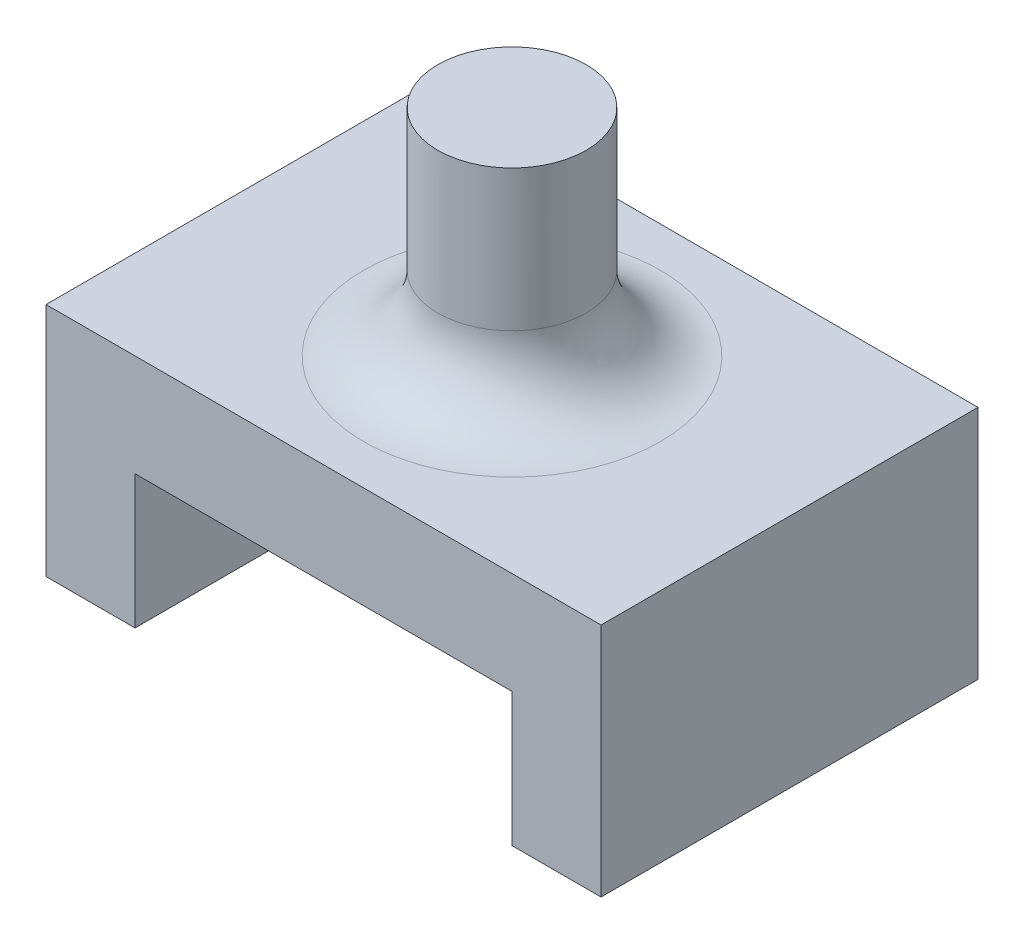
ISO-10303-21;
HEADER;
FILE_DESCRIPTION(('STEP AP214'),'2;1');
FILE_NAME('part.step','',(''),(''),'','','');
FILE_SCHEMA(('AUTOMOTIVE_DESIGN { 1 0 10303 214 1 1 1 1 }'));
ENDSEC;
DATA;
#1=APPLICATION_CONTEXT('core data for automotive mechanical design processes');
#2=APPLICATION_PROTOCOL_DEFINITION('international standard','automotive_design',2000,#1);
#3=PRODUCT_CONTEXT('',#1,'mechanical');
#4=PRODUCT('Part','Part','',(#3));
#5=PRODUCT_RELATED_PRODUCT_CATEGORY('part','',(#4));
#6=PRODUCT_DEFINITION_FORMATION('','',#4);
#7=PRODUCT_DEFINITION_CONTEXT('part definition',#1,'design');
#8=PRODUCT_DEFINITION('design','',#6,#7);
#9=PRODUCT_DEFINITION_SHAPE('','',#8);
#10=(LENGTH_UNIT() NAMED_UNIT(*) SI_UNIT(.MILLI.,.METRE.));
#11=(NAMED_UNIT(*) PLANE_ANGLE_UNIT() SI_UNIT($,.RADIAN.));
#12=(NAMED_UNIT(*) SI_UNIT($,.STERADIAN.) SOLID_ANGLE_UNIT());
#13=UNCERTAINTY_MEASURE_WITH_UNIT(LENGTH_MEASURE(1.E-05),#10,'distance_accuracy_value','');
#14=(GEOMETRIC_REPRESENTATION_CONTEXT(3) GLOBAL_UNCERTAINTY_ASSIGNED_CONTEXT((#13)) GLOBAL_UNIT_ASSIGNED_CONTEXT((#10,
#11,#12)) REPRESENTATION_CONTEXT('',''));
#15=CARTESIAN_POINT('',(0.,0.,0.));
#16=DIRECTION('',(0.,0.,1.));
#17=DIRECTION('',(1.,0.,0.));
#18=AXIS2_PLACEMENT_3D('',#15,#16,#17);
#19=CARTESIAN_POINT('',(-16.1895348837209,0.,25.4));
#20=DIRECTION('',(0.,1.,0.));
#21=DIRECTION('',(0.,0.,1.));
#22=AXIS2_PLACEMENT_3D('',#19,#20,#21);
#23=PLANE('',#22);
#24=DIRECTION('',(1.,0.,0.));
#25=VECTOR('',#24,1.);
#26=CARTESIAN_POINT('',(-16.1895348837209,0.,0.));
#27=LINE('',#26,#25);
#28=CARTESIAN_POINT('',(-16.1895348837209,0.,0.));
#29=VERTEX_POINT('',#28);
#30=CARTESIAN_POINT('',(-10.1895348837209,0.,0.));
#31=VERTEX_POINT('',#30);
#32=EDGE_CURVE('E141',#29,#31,#27,.T.);
#33=ORIENTED_EDGE('',*,*,#32,.T.);
#34=DIRECTION('',(0.,0.,-1.));
#35=VECTOR('',#34,1.);
#36=CARTESIAN_POINT('',(-10.1895348837209,0.,25.4));
#37=LINE('',#36,#35);
#38=CARTESIAN_POINT('',(-10.1895348837209,0.,25.4));
#39=VERTEX_POINT('',#38);
#40=EDGE_CURVE('E183',#39,#31,#37,.T.);
#41=ORIENTED_EDGE('',*,*,#40,.F.);
#42=DIRECTION('',(1.,0.,0.));
#43=VECTOR('',#42,1.);
#44=CARTESIAN_POINT('',(-16.1895348837209,0.,25.4));
#45=LINE('',#44,#43);
#46=CARTESIAN_POINT('',(-16.1895348837209,0.,25.4));
#47=VERTEX_POINT('',#46);
#48=EDGE_CURVE('E164',#47,#39,#45,.T.);
#49=ORIENTED_EDGE('',*,*,#48,.F.);
#50=DIRECTION('',(0.,0.,-1.));
#51=VECTOR('',#50,1.);
#52=CARTESIAN_POINT('',(-16.1895348837209,0.,25.4));
#53=LINE('',#52,#51);
#54=EDGE_CURVE('E137',#47,#29,#53,.T.);
#55=ORIENTED_EDGE('',*,*,#54,.T.);
#56=EDGE_LOOP('',(#33,#41,#49,#55));
#57=FACE_BOUND('',#56,.T.);
#58=ADVANCED_FACE('F38',(#57),#23,.F.);
#59=CARTESIAN_POINT('',(-10.1895348837209,0.,25.4));
#60=DIRECTION('',(-1.,0.,0.));
#61=DIRECTION('',(0.,0.,1.));
#62=AXIS2_PLACEMENT_3D('',#59,#60,#61);
#63=PLANE('',#62);
#64=DIRECTION('',(0.,1.,0.));
#65=VECTOR('',#64,1.);
#66=CARTESIAN_POINT('',(-10.1895348837209,0.,0.));
#67=LINE('',#66,#65);
#68=CARTESIAN_POINT('',(-10.1895348837209,9.,0.));
#69=VERTEX_POINT('',#68);
#70=EDGE_CURVE('E145',#31,#69,#67,.T.);
#71=ORIENTED_EDGE('',*,*,#70,.T.);
#72=DIRECTION('',(0.,0.,-1.));
#73=VECTOR('',#72,1.);
#74=CARTESIAN_POINT('',(-10.1895348837209,9.,25.4));
#75=LINE('',#74,#73);
#76=CARTESIAN_POINT('',(-10.1895348837209,9.,25.4));
#77=VERTEX_POINT('',#76);
#78=EDGE_CURVE('E179',#77,#69,#75,.T.);
#79=ORIENTED_EDGE('',*,*,#78,.F.);
#80=DIRECTION('',(0.,1.,0.));
#81=VECTOR('',#80,1.);
#82=CARTESIAN_POINT('',(-10.1895348837209,0.,25.4));
#83=LINE('',#82,#81);
#84=EDGE_CURVE('E100',#39,#77,#83,.T.);
#85=ORIENTED_EDGE('',*,*,#84,.F.);
#86=ORIENTED_EDGE('',*,*,#40,.T.);
#87=EDGE_LOOP('',(#71,#79,#85,#86));
#88=FACE_BOUND('',#87,.T.);
#89=ADVANCED_FACE('F202',(#88),#63,.F.);
#90=CARTESIAN_POINT('',(-10.1895348837209,9.,25.4));
#91=DIRECTION('',(0.,1.,0.));
#92=DIRECTION('',(0.,0.,1.));
#93=AXIS2_PLACEMENT_3D('',#90,#91,#92);
#94=PLANE('',#93);
#95=DIRECTION('',(1.,0.,0.));
#96=VECTOR('',#95,1.);
#97=CARTESIAN_POINT('',(-10.1895348837209,9.,0.));
#98=LINE('',#97,#96);
#99=CARTESIAN_POINT('',(15.2104651162791,9.,0.));
#100=VERTEX_POINT('',#99);
#101=EDGE_CURVE('E149',#69,#100,#98,.T.);
#102=ORIENTED_EDGE('',*,*,#101,.T.);
#103=DIRECTION('',(0.,0.,-1.));
#104=VECTOR('',#103,1.);
#105=CARTESIAN_POINT('',(15.2104651162791,9.,25.4));
#106=LINE('',#105,#104);
#107=CARTESIAN_POINT('',(15.2104651162791,9.,25.4));
#108=VERTEX_POINT('',#107);
#109=EDGE_CURVE('E175',#108,#100,#106,.T.);
#110=ORIENTED_EDGE('',*,*,#109,.F.);
#111=DIRECTION('',(1.,0.,0.));
#112=VECTOR('',#111,1.);
#113=CARTESIAN_POINT('',(-10.1895348837209,9.,25.4));
#114=LINE('',#113,#112);
#115=EDGE_CURVE('E317',#77,#108,#114,.T.);
#116=ORIENTED_EDGE('',*,*,#115,.F.);
#117=ORIENTED_EDGE('',*,*,#78,.T.);
#118=EDGE_LOOP('',(#102,#110,#116,#117));
#119=FACE_BOUND('',#118,.T.);
#120=ADVANCED_FACE('F207',(#119),#94,.F.);
#121=CARTESIAN_POINT('',(15.2104651162791,9.,25.4));
#122=DIRECTION('',(1.,0.,0.));
#123=DIRECTION('',(0.,1.,0.));
#124=AXIS2_PLACEMENT_3D('',#121,#122,#123);
#125=PLANE('',#124);
#126=DIRECTION('',(0.,-1.,0.));
#127=VECTOR('',#126,1.);
#128=CARTESIAN_POINT('',(15.2104651162791,9.,0.));
#129=LINE('',#128,#127);
#130=CARTESIAN_POINT('',(15.2104651162791,0.,0.));
#131=VERTEX_POINT('',#130);
#132=EDGE_CURVE('E152',#100,#131,#129,.T.);
#133=ORIENTED_EDGE('',*,*,#132,.T.);
#134=DIRECTION('',(0.,0.,-1.));
#135=VECTOR('',#134,1.);
#136=CARTESIAN_POINT('',(15.2104651162791,0.,25.4));
#137=LINE('',#136,#135);
#138=CARTESIAN_POINT('',(15.2104651162791,0.,25.4));
#139=VERTEX_POINT('',#138);
#140=EDGE_CURVE('E171',#139,#131,#137,.T.);
#141=ORIENTED_EDGE('',*,*,#140,.F.);
#142=DIRECTION('',(0.,-1.,0.));
#143=VECTOR('',#142,1.);
#144=CARTESIAN_POINT('',(15.2104651162791,9.,25.4));
#145=LINE('',#144,#143);
#146=EDGE_CURVE('E323',#108,#139,#145,.T.);
#147=ORIENTED_EDGE('',*,*,#146,.F.);
#148=ORIENTED_EDGE('',*,*,#109,.T.);
#149=EDGE_LOOP('',(#133,#141,#147,#148));
#150=FACE_BOUND('',#149,.T.);
#151=ADVANCED_FACE('F212',(#150),#125,.F.);
#152=CARTESIAN_POINT('',(15.2104651162791,0.,25.4));
#153=DIRECTION('',(0.,1.,0.));
#154=DIRECTION('',(0.,0.,1.));
#155=AXIS2_PLACEMENT_3D('',#152,#153,#154);
#156=PLANE('',#155);
#157=DIRECTION('',(1.,0.,0.));
#158=VECTOR('',#157,1.);
#159=CARTESIAN_POINT('',(15.2104651162791,0.,0.));
#160=LINE('',#159,#158);
#161=CARTESIAN_POINT('',(21.2104651162791,0.,0.));
#162=VERTEX_POINT('',#161);
#163=EDGE_CURVE('E155',#131,#162,#160,.T.);
#164=ORIENTED_EDGE('',*,*,#163,.T.);
#165=DIRECTION('',(0.,0.,-1.));
#166=VECTOR('',#165,1.);
#167=CARTESIAN_POINT('',(21.2104651162791,0.,25.4));
#168=LINE('',#167,#166);
#169=CARTESIAN_POINT('',(21.2104651162791,0.,25.4));
#170=VERTEX_POINT('',#169);
#171=EDGE_CURVE('E130',#170,#162,#168,.T.);
#172=ORIENTED_EDGE('',*,*,#171,.F.);
#173=DIRECTION('',(1.,0.,0.));
#174=VECTOR('',#173,1.);
#175=CARTESIAN_POINT('',(15.2104651162791,0.,25.4));
#176=LINE('',#175,#174);
#177=EDGE_CURVE('E119',#139,#170,#176,.T.);
#178=ORIENTED_EDGE('',*,*,#177,.F.);
#179=ORIENTED_EDGE('',*,*,#140,.T.);
#180=EDGE_LOOP('',(#164,#172,#178,#179));
#181=FACE_BOUND('',#180,.T.);
#182=ADVANCED_FACE('F216',(#181),#156,.F.);
#183=CARTESIAN_POINT('',(21.2104651162791,0.,25.4));
#184=DIRECTION('',(-1.,0.,0.));
#185=DIRECTION('',(0.,0.,1.));
#186=AXIS2_PLACEMENT_3D('',#183,#184,#185);
#187=PLANE('',#186);
#188=DIRECTION('',(0.,1.,0.));
#189=VECTOR('',#188,1.);
#190=CARTESIAN_POINT('',(21.2104651162791,0.,0.));
#191=LINE('',#190,#189);
#192=CARTESIAN_POINT('',(21.2104651162791,15.875,0.));
#193=VERTEX_POINT('',#192);
#194=EDGE_CURVE('E128',#162,#193,#191,.T.);
#195=ORIENTED_EDGE('',*,*,#194,.T.);
#196=DIRECTION('',(0.,0.,-1.));
#197=VECTOR('',#196,1.);
#198=CARTESIAN_POINT('',(21.2104651162791,15.875,25.4));
#199=LINE('',#198,#197);
#200=CARTESIAN_POINT('',(21.2104651162791,15.875,25.4));
#201=VERTEX_POINT('',#200);
#202=EDGE_CURVE('E125',#201,#193,#199,.T.);
#203=ORIENTED_EDGE('',*,*,#202,.F.);
#204=DIRECTION('',(0.,1.,0.));
#205=VECTOR('',#204,1.);
#206=CARTESIAN_POINT('',(21.2104651162791,0.,25.4));
#207=LINE('',#206,#205);
#208=EDGE_CURVE('E113',#170,#201,#207,.T.);
#209=ORIENTED_EDGE('',*,*,#208,.F.);
#210=ORIENTED_EDGE('',*,*,#171,.T.);
#211=EDGE_LOOP('',(#195,#203,#209,#210));
#212=FACE_BOUND('',#211,.T.);
#213=ADVANCED_FACE('F126',(#212),#187,.F.);
#214=CARTESIAN_POINT('',(21.2104651162791,15.875,25.4));
#215=DIRECTION('',(0.,-1.,0.));
#216=DIRECTION('',(1.,0.,0.));
#217=AXIS2_PLACEMENT_3D('',#214,#215,#216);
#218=PLANE('',#217);
#219=CARTESIAN_POINT('',(2.51046511627907,15.875,12.7));
#220=DIRECTION('',(0.,-1.,0.));
#221=DIRECTION('',(1.,0.,0.));
#222=AXIS2_PLACEMENT_3D('',#219,#220,#221);
#223=CIRCLE('',#222,10.);
#224=CARTESIAN_POINT('',(12.5104651162791,15.875,12.7));
#225=VERTEX_POINT('',#224);
#226=EDGE_CURVE('E11',#225,#225,#223,.T.);
#227=ORIENTED_EDGE('',*,*,#226,.T.);
#228=EDGE_LOOP('',(#227));
#229=FACE_BOUND('',#228,.T.);
#230=DIRECTION('',(-1.,0.,0.));
#231=VECTOR('',#230,1.);
#232=CARTESIAN_POINT('',(21.2104651162791,15.875,0.));
#233=LINE('',#232,#231);
#234=CARTESIAN_POINT('',(-16.1895348837209,15.875,0.));
#235=VERTEX_POINT('',#234);
#236=EDGE_CURVE('E85',#193,#235,#233,.T.);
#237=ORIENTED_EDGE('',*,*,#236,.T.);
#238=DIRECTION('',(0.,0.,-1.));
#239=VECTOR('',#238,1.);
#240=CARTESIAN_POINT('',(-16.1895348837209,15.875,25.4));
#241=LINE('',#240,#239);
#242=CARTESIAN_POINT('',(-16.1895348837209,15.875,25.4));
#243=VERTEX_POINT('',#242);
#244=EDGE_CURVE('E131',#243,#235,#241,.T.);
#245=ORIENTED_EDGE('',*,*,#244,.F.);
#246=DIRECTION('',(-1.,0.,0.));
#247=VECTOR('',#246,1.);
#248=CARTESIAN_POINT('',(21.2104651162791,15.875,25.4));
#249=LINE('',#248,#247);
#250=EDGE_CURVE('E117',#201,#243,#249,.T.);
#251=ORIENTED_EDGE('',*,*,#250,.F.);
#252=ORIENTED_EDGE('',*,*,#202,.T.);
#253=EDGE_LOOP('',(#237,#245,#251,#252));
#254=FACE_BOUND('',#253,.T.);
#255=ADVANCED_FACE('F133',(#229,#254),#218,.F.);
#256=CARTESIAN_POINT('',(-16.1895348837209,15.875,25.4));
#257=DIRECTION('',(1.,0.,0.));
#258=DIRECTION('',(0.,1.,0.));
#259=AXIS2_PLACEMENT_3D('',#256,#257,#258);
#260=PLANE('',#259);
#261=DIRECTION('',(0.,-1.,0.));
#262=VECTOR('',#261,1.);
#263=CARTESIAN_POINT('',(-16.1895348837209,15.875,0.));
#264=LINE('',#263,#262);
#265=EDGE_CURVE('E91',#235,#29,#264,.T.);
#266=ORIENTED_EDGE('',*,*,#265,.T.);
#267=ORIENTED_EDGE('',*,*,#54,.F.);
#268=DIRECTION('',(0.,-1.,0.));
#269=VECTOR('',#268,1.);
#270=CARTESIAN_POINT('',(-16.1895348837209,15.875,25.4));
#271=LINE('',#270,#269);
#272=EDGE_CURVE('E56',#243,#47,#271,.T.);
#273=ORIENTED_EDGE('',*,*,#272,.F.);
#274=ORIENTED_EDGE('',*,*,#244,.T.);
#275=EDGE_LOOP('',(#266,#267,#273,#274));
#276=FACE_BOUND('',#275,.T.);
#277=ADVANCED_FACE('F225',(#276),#260,.F.);
#278=CARTESIAN_POINT('',(0.,0.,25.4));
#279=DIRECTION('',(0.,0.,1.));
#280=DIRECTION('',(1.,0.,0.));
#281=AXIS2_PLACEMENT_3D('',#278,#279,#280);
#282=PLANE('',#281);
#283=ORIENTED_EDGE('',*,*,#48,.T.);
#284=ORIENTED_EDGE('',*,*,#84,.T.);
#285=ORIENTED_EDGE('',*,*,#115,.T.);
#286=ORIENTED_EDGE('',*,*,#146,.T.);
#287=ORIENTED_EDGE('',*,*,#177,.T.);
#288=ORIENTED_EDGE('',*,*,#208,.T.);
#289=ORIENTED_EDGE('',*,*,#250,.T.);
#290=ORIENTED_EDGE('',*,*,#272,.T.);
#291=EDGE_LOOP('',(#283,#284,#285,#286,#287,#288,#289,#290));
#292=FACE_BOUND('',#291,.T.);
#293=ADVANCED_FACE('F115',(#292),#282,.T.);
#294=CARTESIAN_POINT('',(0.,0.,0.));
#295=DIRECTION('',(0.,0.,1.));
#296=DIRECTION('',(1.,0.,0.));
#297=AXIS2_PLACEMENT_3D('',#294,#295,#296);
#298=PLANE('',#297);
#299=ORIENTED_EDGE('',*,*,#32,.F.);
#300=ORIENTED_EDGE('',*,*,#265,.F.);
#301=ORIENTED_EDGE('',*,*,#236,.F.);
#302=ORIENTED_EDGE('',*,*,#194,.F.);
#303=ORIENTED_EDGE('',*,*,#163,.F.);
#304=ORIENTED_EDGE('',*,*,#132,.F.);
#305=ORIENTED_EDGE('',*,*,#101,.F.);
#306=ORIENTED_EDGE('',*,*,#70,.F.);
#307=EDGE_LOOP('',(#299,#300,#301,#302,#303,#304,#305,#306));
#308=FACE_BOUND('',#307,.T.);
#309=ADVANCED_FACE('F229',(#308),#298,.F.);
#310=CARTESIAN_POINT('',(2.51046511627907,30.375,12.7));
#311=DIRECTION('',(0.,-1.,0.));
#312=DIRECTION('',(1.,0.,0.));
#313=AXIS2_PLACEMENT_3D('',#310,#311,#312);
#314=CYLINDRICAL_SURFACE('',#313,5.);
#315=CARTESIAN_POINT('',(2.51046511627907,20.875,12.7));
#316=DIRECTION('',(0.,-1.,0.));
#317=DIRECTION('',(1.,0.,0.));
#318=AXIS2_PLACEMENT_3D('',#315,#316,#317);
#319=CIRCLE('',#318,5.);
#320=CARTESIAN_POINT('',(7.51046511627907,20.875,12.7));
#321=VERTEX_POINT('',#320);
#322=EDGE_CURVE('E48',#321,#321,#319,.F.);
#323=ORIENTED_EDGE('',*,*,#322,.T.);
#324=EDGE_LOOP('',(#323));
#325=FACE_BOUND('',#324,.T.);
#326=CARTESIAN_POINT('',(2.51046511627907,30.375,12.7));
#327=DIRECTION('',(0.,1.,0.));
#328=DIRECTION('',(-1.,0.,0.));
#329=AXIS2_PLACEMENT_3D('',#326,#327,#328);
#330=CIRCLE('',#329,5.);
#331=CARTESIAN_POINT('',(-2.48953488372093,30.375,12.7));
#332=VERTEX_POINT('',#331);
#333=EDGE_CURVE('E146',#332,#332,#330,.T.);
#334=ORIENTED_EDGE('',*,*,#333,.F.);
#335=EDGE_LOOP('',(#334));
#336=FACE_BOUND('',#335,.T.);
#337=ADVANCED_FACE('F189',(#325,#336),#314,.T.);
#338=CARTESIAN_POINT('',(2.51046511627907,30.375,12.7));
#339=DIRECTION('',(0.,1.,0.));
#340=DIRECTION('',(-1.,0.,0.));
#341=AXIS2_PLACEMENT_3D('',#338,#339,#340);
#342=PLANE('',#341);
#343=ORIENTED_EDGE('',*,*,#333,.T.);
#344=EDGE_LOOP('',(#343));
#345=FACE_BOUND('',#344,.T.);
#346=ADVANCED_FACE('F193',(#345),#342,.T.);
#347=CARTESIAN_POINT('',(2.51046511627907,20.875,12.7));
#348=DIRECTION('',(0.,-1.,0.));
#349=DIRECTION('',(1.,0.,0.));
#350=AXIS2_PLACEMENT_3D('',#347,#348,#349);
#351=TOROIDAL_SURFACE('',#350,10.,5.);
#352=ORIENTED_EDGE('',*,*,#226,.F.);
#353=EDGE_LOOP('',(#352));
#354=FACE_BOUND('',#353,.T.);
#355=ORIENTED_EDGE('',*,*,#322,.F.);
#356=EDGE_LOOP('',(#355));
#357=FACE_BOUND('',#356,.T.);
#358=ADVANCED_FACE('F40',(#354,#357),#351,.F.);
#359=CLOSED_SHELL('',(#58,#89,#120,#151,#182,#213,#255,#277,#293,#309,#337,#346,#358));
#360=MANIFOLD_SOLID_BREP('B2',#359);
#361=ADVANCED_BREP_SHAPE_REPRESENTATION('',(#18,#360),#14);
#362=SHAPE_DEFINITION_REPRESENTATION(#9,#361);
ENDSEC;
END-ISO-10303-21;
